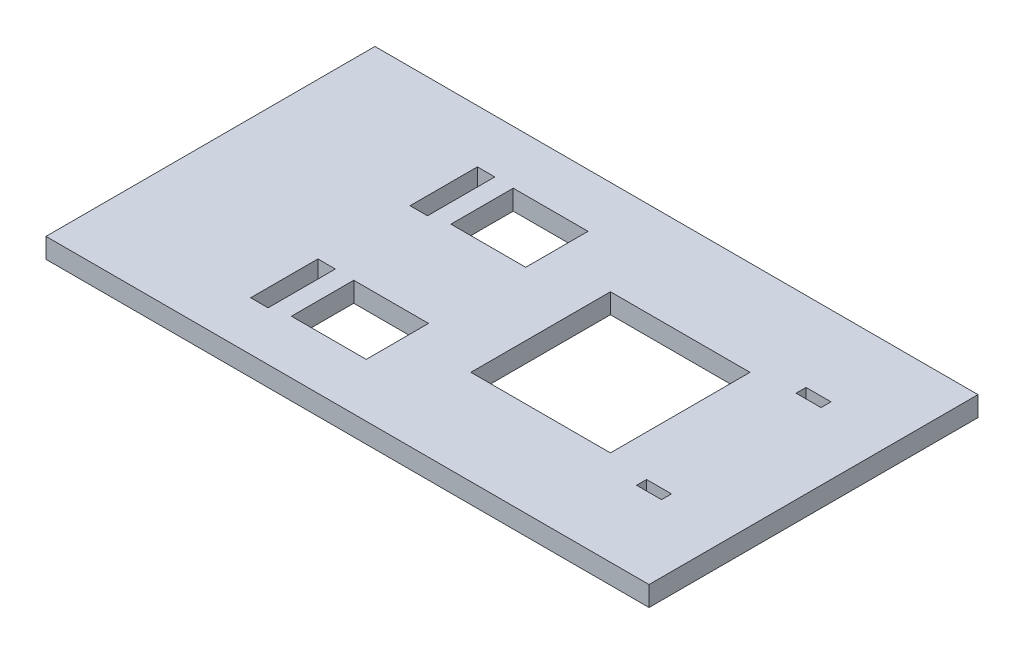
ISO-10303-21;
HEADER;
FILE_DESCRIPTION(('STEP AP214'),'2;1');
FILE_NAME('part.step','',(''),(''),'','','');
FILE_SCHEMA(('AUTOMOTIVE_DESIGN { 1 0 10303 214 1 1 1 1 }'));
ENDSEC;
DATA;
#1=APPLICATION_CONTEXT('core data for automotive mechanical design processes');
#2=APPLICATION_PROTOCOL_DEFINITION('international standard','automotive_design',2000,#1);
#3=PRODUCT_CONTEXT('',#1,'mechanical');
#4=PRODUCT('Part','Part','',(#3));
#5=PRODUCT_RELATED_PRODUCT_CATEGORY('part','',(#4));
#6=PRODUCT_DEFINITION_FORMATION('','',#4);
#7=PRODUCT_DEFINITION_CONTEXT('part definition',#1,'design');
#8=PRODUCT_DEFINITION('design','',#6,#7);
#9=PRODUCT_DEFINITION_SHAPE('','',#8);
#10=(LENGTH_UNIT() NAMED_UNIT(*) SI_UNIT(.MILLI.,.METRE.));
#11=(NAMED_UNIT(*) PLANE_ANGLE_UNIT() SI_UNIT($,.RADIAN.));
#12=(NAMED_UNIT(*) SI_UNIT($,.STERADIAN.) SOLID_ANGLE_UNIT());
#13=UNCERTAINTY_MEASURE_WITH_UNIT(LENGTH_MEASURE(1.E-05),#10,'distance_accuracy_value','');
#14=(GEOMETRIC_REPRESENTATION_CONTEXT(3) GLOBAL_UNCERTAINTY_ASSIGNED_CONTEXT((#13)) GLOBAL_UNIT_ASSIGNED_CONTEXT((#10,
#11,#12)) REPRESENTATION_CONTEXT('',''));
#15=CARTESIAN_POINT('',(0.,0.,0.));
#16=DIRECTION('',(0.,0.,1.));
#17=DIRECTION('',(1.,0.,0.));
#18=AXIS2_PLACEMENT_3D('',#15,#16,#17);
#19=CARTESIAN_POINT('',(0.,4.,0.));
#20=DIRECTION('',(1.,0.,0.));
#21=DIRECTION('',(0.,0.,-1.));
#22=AXIS2_PLACEMENT_3D('',#19,#20,#21);
#23=PLANE('',#22);
#24=DIRECTION('',(0.,0.,1.));
#25=VECTOR('',#24,1.);
#26=CARTESIAN_POINT('',(0.,0.,0.));
#27=LINE('',#26,#25);
#28=CARTESIAN_POINT('',(0.,0.,0.));
#29=VERTEX_POINT('',#28);
#30=CARTESIAN_POINT('',(0.,0.,66.));
#31=VERTEX_POINT('',#30);
#32=EDGE_CURVE('E403',#29,#31,#27,.T.);
#33=ORIENTED_EDGE('',*,*,#32,.T.);
#34=DIRECTION('',(0.,-1.,0.));
#35=VECTOR('',#34,1.);
#36=CARTESIAN_POINT('',(0.,4.,66.));
#37=LINE('',#36,#35);
#38=CARTESIAN_POINT('',(0.,4.,66.));
#39=VERTEX_POINT('',#38);
#40=EDGE_CURVE('E11',#39,#31,#37,.T.);
#41=ORIENTED_EDGE('',*,*,#40,.F.);
#42=DIRECTION('',(0.,0.,1.));
#43=VECTOR('',#42,1.);
#44=CARTESIAN_POINT('',(0.,4.,0.));
#45=LINE('',#44,#43);
#46=CARTESIAN_POINT('',(0.,4.,0.));
#47=VERTEX_POINT('',#46);
#48=EDGE_CURVE('E472',#47,#39,#45,.T.);
#49=ORIENTED_EDGE('',*,*,#48,.F.);
#50=DIRECTION('',(0.,-1.,0.));
#51=VECTOR('',#50,1.);
#52=CARTESIAN_POINT('',(0.,4.,0.));
#53=LINE('',#52,#51);
#54=EDGE_CURVE('E482',#47,#29,#53,.T.);
#55=ORIENTED_EDGE('',*,*,#54,.T.);
#56=EDGE_LOOP('',(#33,#41,#49,#55));
#57=FACE_BOUND('',#56,.T.);
#58=ADVANCED_FACE('F34',(#57),#23,.F.);
#59=CARTESIAN_POINT('',(0.,4.,66.));
#60=DIRECTION('',(0.,0.,-1.));
#61=DIRECTION('',(-1.,0.,0.));
#62=AXIS2_PLACEMENT_3D('',#59,#60,#61);
#63=PLANE('',#62);
#64=DIRECTION('',(1.,0.,0.));
#65=VECTOR('',#64,1.);
#66=CARTESIAN_POINT('',(0.,0.,66.));
#67=LINE('',#66,#65);
#68=CARTESIAN_POINT('',(121.,0.,66.));
#69=VERTEX_POINT('',#68);
#70=EDGE_CURVE('E485',#31,#69,#67,.T.);
#71=ORIENTED_EDGE('',*,*,#70,.T.);
#72=DIRECTION('',(0.,-1.,0.));
#73=VECTOR('',#72,1.);
#74=CARTESIAN_POINT('',(121.,4.,66.));
#75=LINE('',#74,#73);
#76=CARTESIAN_POINT('',(121.,4.,66.));
#77=VERTEX_POINT('',#76);
#78=EDGE_CURVE('E41',#77,#69,#75,.T.);
#79=ORIENTED_EDGE('',*,*,#78,.F.);
#80=DIRECTION('',(1.,0.,0.));
#81=VECTOR('',#80,1.);
#82=CARTESIAN_POINT('',(0.,4.,66.));
#83=LINE('',#82,#81);
#84=EDGE_CURVE('E475',#39,#77,#83,.T.);
#85=ORIENTED_EDGE('',*,*,#84,.F.);
#86=ORIENTED_EDGE('',*,*,#40,.T.);
#87=EDGE_LOOP('',(#71,#79,#85,#86));
#88=FACE_BOUND('',#87,.T.);
#89=ADVANCED_FACE('F514',(#88),#63,.F.);
#90=CARTESIAN_POINT('',(121.,4.,0.));
#91=DIRECTION('',(-1.,0.,0.));
#92=DIRECTION('',(0.,0.,1.));
#93=AXIS2_PLACEMENT_3D('',#90,#91,#92);
#94=PLANE('',#93);
#95=DIRECTION('',(0.,0.,-1.));
#96=VECTOR('',#95,1.);
#97=CARTESIAN_POINT('',(121.,0.,0.));
#98=LINE('',#97,#96);
#99=CARTESIAN_POINT('',(121.,0.,0.));
#100=VERTEX_POINT('',#99);
#101=EDGE_CURVE('E487',#69,#100,#98,.T.);
#102=ORIENTED_EDGE('',*,*,#101,.T.);
#103=DIRECTION('',(0.,-1.,0.));
#104=VECTOR('',#103,1.);
#105=CARTESIAN_POINT('',(121.,4.,0.));
#106=LINE('',#105,#104);
#107=CARTESIAN_POINT('',(121.,4.,0.));
#108=VERTEX_POINT('',#107);
#109=EDGE_CURVE('E492',#108,#100,#106,.T.);
#110=ORIENTED_EDGE('',*,*,#109,.F.);
#111=DIRECTION('',(0.,0.,-1.));
#112=VECTOR('',#111,1.);
#113=CARTESIAN_POINT('',(121.,4.,0.));
#114=LINE('',#113,#112);
#115=EDGE_CURVE('E478',#77,#108,#114,.T.);
#116=ORIENTED_EDGE('',*,*,#115,.F.);
#117=ORIENTED_EDGE('',*,*,#78,.T.);
#118=EDGE_LOOP('',(#102,#110,#116,#117));
#119=FACE_BOUND('',#118,.T.);
#120=ADVANCED_FACE('F499',(#119),#94,.F.);
#121=CARTESIAN_POINT('',(0.,4.,0.));
#122=DIRECTION('',(0.,0.,1.));
#123=DIRECTION('',(1.,0.,0.));
#124=AXIS2_PLACEMENT_3D('',#121,#122,#123);
#125=PLANE('',#124);
#126=DIRECTION('',(-1.,0.,0.));
#127=VECTOR('',#126,1.);
#128=CARTESIAN_POINT('',(0.,0.,0.));
#129=LINE('',#128,#127);
#130=EDGE_CURVE('E476',#100,#29,#129,.T.);
#131=ORIENTED_EDGE('',*,*,#130,.T.);
#132=ORIENTED_EDGE('',*,*,#54,.F.);
#133=DIRECTION('',(-1.,0.,0.));
#134=VECTOR('',#133,1.);
#135=CARTESIAN_POINT('',(0.,4.,0.));
#136=LINE('',#135,#134);
#137=EDGE_CURVE('E480',#108,#47,#136,.T.);
#138=ORIENTED_EDGE('',*,*,#137,.F.);
#139=ORIENTED_EDGE('',*,*,#109,.T.);
#140=EDGE_LOOP('',(#131,#132,#138,#139));
#141=FACE_BOUND('',#140,.T.);
#142=ADVANCED_FACE('F507',(#141),#125,.F.);
#143=CARTESIAN_POINT('',(0.,4.,0.));
#144=DIRECTION('',(0.,1.,0.));
#145=DIRECTION('',(0.,0.,1.));
#146=AXIS2_PLACEMENT_3D('',#143,#144,#145);
#147=PLANE('',#146);
#148=DIRECTION('',(0.,0.,1.));
#149=VECTOR('',#148,1.);
#150=CARTESIAN_POINT('',(31.2,4.,42.6458957568744));
#151=LINE('',#150,#149);
#152=CARTESIAN_POINT('',(31.2,4.,42.6458957568744));
#153=VERTEX_POINT('',#152);
#154=CARTESIAN_POINT('',(31.2,4.,56.1458957568744));
#155=VERTEX_POINT('',#154);
#156=EDGE_CURVE('E48',#153,#155,#151,.T.);
#157=ORIENTED_EDGE('',*,*,#156,.F.);
#158=DIRECTION('',(-1.,0.,0.));
#159=VECTOR('',#158,1.);
#160=CARTESIAN_POINT('',(31.2,4.,42.6458957568744));
#161=LINE('',#160,#159);
#162=CARTESIAN_POINT('',(34.7,4.,42.6458957568744));
#163=VERTEX_POINT('',#162);
#164=EDGE_CURVE('E263',#163,#153,#161,.T.);
#165=ORIENTED_EDGE('',*,*,#164,.F.);
#166=DIRECTION('',(0.,0.,-1.));
#167=VECTOR('',#166,1.);
#168=CARTESIAN_POINT('',(34.7,4.,42.6458957568744));
#169=LINE('',#168,#167);
#170=CARTESIAN_POINT('',(34.7,4.,56.1458957568744));
#171=VERTEX_POINT('',#170);
#172=EDGE_CURVE('E266',#171,#163,#169,.T.);
#173=ORIENTED_EDGE('',*,*,#172,.F.);
#174=DIRECTION('',(1.,0.,0.));
#175=VECTOR('',#174,1.);
#176=CARTESIAN_POINT('',(31.2,4.,56.1458957568744));
#177=LINE('',#176,#175);
#178=EDGE_CURVE('E272',#155,#171,#177,.T.);
#179=ORIENTED_EDGE('',*,*,#178,.F.);
#180=EDGE_LOOP('',(#157,#165,#173,#179));
#181=FACE_BOUND('',#180,.T.);
#182=DIRECTION('',(0.,0.,1.));
#183=VECTOR('',#182,1.);
#184=CARTESIAN_POINT('',(31.2,4.,10.6496253107313));
#185=LINE('',#184,#183);
#186=CARTESIAN_POINT('',(31.2,4.,10.6496253107313));
#187=VERTEX_POINT('',#186);
#188=CARTESIAN_POINT('',(31.2,4.,24.1496253107313));
#189=VERTEX_POINT('',#188);
#190=EDGE_CURVE('E56',#187,#189,#185,.T.);
#191=ORIENTED_EDGE('',*,*,#190,.F.);
#192=DIRECTION('',(-1.,0.,0.));
#193=VECTOR('',#192,1.);
#194=CARTESIAN_POINT('',(31.2,4.,10.6496253107313));
#195=LINE('',#194,#193);
#196=CARTESIAN_POINT('',(34.7,4.,10.6496253107313));
#197=VERTEX_POINT('',#196);
#198=EDGE_CURVE('E287',#197,#187,#195,.T.);
#199=ORIENTED_EDGE('',*,*,#198,.F.);
#200=DIRECTION('',(0.,0.,-1.));
#201=VECTOR('',#200,1.);
#202=CARTESIAN_POINT('',(34.7,4.,10.6496253107313));
#203=LINE('',#202,#201);
#204=CARTESIAN_POINT('',(34.7,4.,24.1496253107313));
#205=VERTEX_POINT('',#204);
#206=EDGE_CURVE('E301',#205,#197,#203,.T.);
#207=ORIENTED_EDGE('',*,*,#206,.F.);
#208=DIRECTION('',(1.,0.,0.));
#209=VECTOR('',#208,1.);
#210=CARTESIAN_POINT('',(31.2,4.,24.1496253107313));
#211=LINE('',#210,#209);
#212=EDGE_CURVE('E298',#189,#205,#211,.T.);
#213=ORIENTED_EDGE('',*,*,#212,.F.);
#214=EDGE_LOOP('',(#191,#199,#207,#213));
#215=FACE_BOUND('',#214,.T.);
#216=DIRECTION('',(0.,0.,1.));
#217=VECTOR('',#216,1.);
#218=CARTESIAN_POINT('',(107.5,4.,50.));
#219=LINE('',#218,#217);
#220=CARTESIAN_POINT('',(107.5,4.,48.));
#221=VERTEX_POINT('',#220);
#222=CARTESIAN_POINT('',(107.5,4.,50.));
#223=VERTEX_POINT('',#222);
#224=EDGE_CURVE('E312',#221,#223,#219,.T.);
#225=ORIENTED_EDGE('',*,*,#224,.T.);
#226=DIRECTION('',(-1.,0.,0.));
#227=VECTOR('',#226,1.);
#228=CARTESIAN_POINT('',(107.5,4.,50.));
#229=LINE('',#228,#227);
#230=CARTESIAN_POINT('',(102.5,4.,50.));
#231=VERTEX_POINT('',#230);
#232=EDGE_CURVE('E315',#223,#231,#229,.T.);
#233=ORIENTED_EDGE('',*,*,#232,.T.);
#234=DIRECTION('',(0.,0.,-1.));
#235=VECTOR('',#234,1.);
#236=CARTESIAN_POINT('',(102.5,4.,50.));
#237=LINE('',#236,#235);
#238=CARTESIAN_POINT('',(102.5,4.,48.));
#239=VERTEX_POINT('',#238);
#240=EDGE_CURVE('E319',#231,#239,#237,.T.);
#241=ORIENTED_EDGE('',*,*,#240,.T.);
#242=DIRECTION('',(1.,0.,0.));
#243=VECTOR('',#242,1.);
#244=CARTESIAN_POINT('',(107.5,4.,48.));
#245=LINE('',#244,#243);
#246=EDGE_CURVE('E322',#239,#221,#245,.T.);
#247=ORIENTED_EDGE('',*,*,#246,.T.);
#248=EDGE_LOOP('',(#225,#233,#241,#247));
#249=FACE_BOUND('',#248,.T.);
#250=DIRECTION('',(0.,0.,-1.));
#251=VECTOR('',#250,1.);
#252=CARTESIAN_POINT('',(102.5,4.,16.));
#253=LINE('',#252,#251);
#254=CARTESIAN_POINT('',(102.5,4.,18.));
#255=VERTEX_POINT('',#254);
#256=CARTESIAN_POINT('',(102.5,4.,16.));
#257=VERTEX_POINT('',#256);
#258=EDGE_CURVE('E346',#255,#257,#253,.T.);
#259=ORIENTED_EDGE('',*,*,#258,.T.);
#260=DIRECTION('',(1.,0.,0.));
#261=VECTOR('',#260,1.);
#262=CARTESIAN_POINT('',(102.5,4.,16.));
#263=LINE('',#262,#261);
#264=CARTESIAN_POINT('',(107.5,4.,16.));
#265=VERTEX_POINT('',#264);
#266=EDGE_CURVE('E349',#257,#265,#263,.T.);
#267=ORIENTED_EDGE('',*,*,#266,.T.);
#268=DIRECTION('',(0.,0.,1.));
#269=VECTOR('',#268,1.);
#270=CARTESIAN_POINT('',(107.5,4.,16.));
#271=LINE('',#270,#269);
#272=CARTESIAN_POINT('',(107.5,4.,18.));
#273=VERTEX_POINT('',#272);
#274=EDGE_CURVE('E353',#265,#273,#271,.T.);
#275=ORIENTED_EDGE('',*,*,#274,.T.);
#276=DIRECTION('',(-1.,0.,0.));
#277=VECTOR('',#276,1.);
#278=CARTESIAN_POINT('',(102.5,4.,18.));
#279=LINE('',#278,#277);
#280=EDGE_CURVE('E356',#273,#255,#279,.T.);
#281=ORIENTED_EDGE('',*,*,#280,.T.);
#282=EDGE_LOOP('',(#259,#267,#275,#281));
#283=FACE_BOUND('',#282,.T.);
#284=DIRECTION('',(0.,0.,-1.));
#285=VECTOR('',#284,1.);
#286=CARTESIAN_POINT('',(94.25,4.,19.));
#287=LINE('',#286,#285);
#288=CARTESIAN_POINT('',(94.25,4.,47.));
#289=VERTEX_POINT('',#288);
#290=CARTESIAN_POINT('',(94.25,4.,19.));
#291=VERTEX_POINT('',#290);
#292=EDGE_CURVE('E390',#289,#291,#287,.T.);
#293=ORIENTED_EDGE('',*,*,#292,.F.);
#294=DIRECTION('',(1.,0.,0.));
#295=VECTOR('',#294,1.);
#296=CARTESIAN_POINT('',(66.25,4.,47.));
#297=LINE('',#296,#295);
#298=CARTESIAN_POINT('',(66.25,4.,47.));
#299=VERTEX_POINT('',#298);
#300=EDGE_CURVE('E380',#299,#289,#297,.T.);
#301=ORIENTED_EDGE('',*,*,#300,.F.);
#302=DIRECTION('',(0.,0.,1.));
#303=VECTOR('',#302,1.);
#304=CARTESIAN_POINT('',(66.25,4.,19.));
#305=LINE('',#304,#303);
#306=CARTESIAN_POINT('',(66.25,4.,19.));
#307=VERTEX_POINT('',#306);
#308=EDGE_CURVE('E396',#307,#299,#305,.T.);
#309=ORIENTED_EDGE('',*,*,#308,.F.);
#310=DIRECTION('',(-1.,0.,0.));
#311=VECTOR('',#310,1.);
#312=CARTESIAN_POINT('',(66.25,4.,19.));
#313=LINE('',#312,#311);
#314=EDGE_CURVE('E392',#291,#307,#313,.T.);
#315=ORIENTED_EDGE('',*,*,#314,.F.);
#316=EDGE_LOOP('',(#293,#301,#309,#315));
#317=FACE_BOUND('',#316,.T.);
#318=DIRECTION('',(0.,0.,-1.));
#319=VECTOR('',#318,1.);
#320=CARTESIAN_POINT('',(53.5,4.,23.25));
#321=LINE('',#320,#319);
#322=CARTESIAN_POINT('',(53.5,4.,23.25));
#323=VERTEX_POINT('',#322);
#324=CARTESIAN_POINT('',(53.5,4.,10.75));
#325=VERTEX_POINT('',#324);
#326=EDGE_CURVE('E424',#323,#325,#321,.T.);
#327=ORIENTED_EDGE('',*,*,#326,.F.);
#328=DIRECTION('',(1.,0.,0.));
#329=VECTOR('',#328,1.);
#330=CARTESIAN_POINT('',(38.5,4.,23.25));
#331=LINE('',#330,#329);
#332=CARTESIAN_POINT('',(38.5,4.,23.25));
#333=VERTEX_POINT('',#332);
#334=EDGE_CURVE('E414',#333,#323,#331,.T.);
#335=ORIENTED_EDGE('',*,*,#334,.F.);
#336=DIRECTION('',(0.,0.,1.));
#337=VECTOR('',#336,1.);
#338=CARTESIAN_POINT('',(38.5,4.,23.25));
#339=LINE('',#338,#337);
#340=CARTESIAN_POINT('',(38.5,4.,10.75));
#341=VERTEX_POINT('',#340);
#342=EDGE_CURVE('E430',#341,#333,#339,.T.);
#343=ORIENTED_EDGE('',*,*,#342,.F.);
#344=DIRECTION('',(-1.,0.,0.));
#345=VECTOR('',#344,1.);
#346=CARTESIAN_POINT('',(38.5,4.,10.75));
#347=LINE('',#346,#345);
#348=EDGE_CURVE('E426',#325,#341,#347,.T.);
#349=ORIENTED_EDGE('',*,*,#348,.F.);
#350=EDGE_LOOP('',(#327,#335,#343,#349));
#351=FACE_BOUND('',#350,.T.);
#352=DIRECTION('',(0.,0.,-1.));
#353=VECTOR('',#352,1.);
#354=CARTESIAN_POINT('',(53.5,4.,55.25));
#355=LINE('',#354,#353);
#356=CARTESIAN_POINT('',(53.5,4.,55.25));
#357=VERTEX_POINT('',#356);
#358=CARTESIAN_POINT('',(53.5,4.,42.75));
#359=VERTEX_POINT('',#358);
#360=EDGE_CURVE('E339',#357,#359,#355,.T.);
#361=ORIENTED_EDGE('',*,*,#360,.F.);
#362=DIRECTION('',(1.,0.,0.));
#363=VECTOR('',#362,1.);
#364=CARTESIAN_POINT('',(38.5,4.,55.25));
#365=LINE('',#364,#363);
#366=CARTESIAN_POINT('',(38.5,4.,55.25));
#367=VERTEX_POINT('',#366);
#368=EDGE_CURVE('E446',#367,#357,#365,.T.);
#369=ORIENTED_EDGE('',*,*,#368,.F.);
#370=DIRECTION('',(0.,0.,1.));
#371=VECTOR('',#370,1.);
#372=CARTESIAN_POINT('',(38.5,4.,55.25));
#373=LINE('',#372,#371);
#374=CARTESIAN_POINT('',(38.5,4.,42.75));
#375=VERTEX_POINT('',#374);
#376=EDGE_CURVE('E460',#375,#367,#373,.T.);
#377=ORIENTED_EDGE('',*,*,#376,.F.);
#378=DIRECTION('',(-1.,0.,0.));
#379=VECTOR('',#378,1.);
#380=CARTESIAN_POINT('',(38.5,4.,42.75));
#381=LINE('',#380,#379);
#382=EDGE_CURVE('E457',#359,#375,#381,.T.);
#383=ORIENTED_EDGE('',*,*,#382,.F.);
#384=EDGE_LOOP('',(#361,#369,#377,#383));
#385=FACE_BOUND('',#384,.T.);
#386=ORIENTED_EDGE('',*,*,#48,.T.);
#387=ORIENTED_EDGE('',*,*,#84,.T.);
#388=ORIENTED_EDGE('',*,*,#115,.T.);
#389=ORIENTED_EDGE('',*,*,#137,.T.);
#390=EDGE_LOOP('',(#386,#387,#388,#389));
#391=FACE_BOUND('',#390,.T.);
#392=ADVANCED_FACE('F513',(#181,#215,#249,#283,#317,#351,#385,#391),#147,.T.);
#393=CARTESIAN_POINT('',(0.,0.,0.));
#394=DIRECTION('',(0.,1.,0.));
#395=DIRECTION('',(0.,0.,1.));
#396=AXIS2_PLACEMENT_3D('',#393,#394,#395);
#397=PLANE('',#396);
#398=DIRECTION('',(-1.,0.,0.));
#399=VECTOR('',#398,1.);
#400=CARTESIAN_POINT('',(31.2,0.,42.6458957568744));
#401=LINE('',#400,#399);
#402=CARTESIAN_POINT('',(34.7,0.,42.6458957568744));
#403=VERTEX_POINT('',#402);
#404=CARTESIAN_POINT('',(31.2,0.,42.6458957568744));
#405=VERTEX_POINT('',#404);
#406=EDGE_CURVE('E250',#403,#405,#401,.T.);
#407=ORIENTED_EDGE('',*,*,#406,.T.);
#408=DIRECTION('',(0.,0.,1.));
#409=VECTOR('',#408,1.);
#410=CARTESIAN_POINT('',(31.2,0.,42.6458957568744));
#411=LINE('',#410,#409);
#412=CARTESIAN_POINT('',(31.2,0.,56.1458957568744));
#413=VERTEX_POINT('',#412);
#414=EDGE_CURVE('E244',#405,#413,#411,.T.);
#415=ORIENTED_EDGE('',*,*,#414,.T.);
#416=DIRECTION('',(1.,0.,0.));
#417=VECTOR('',#416,1.);
#418=CARTESIAN_POINT('',(31.2,0.,56.1458957568744));
#419=LINE('',#418,#417);
#420=CARTESIAN_POINT('',(34.7,0.,56.1458957568744));
#421=VERTEX_POINT('',#420);
#422=EDGE_CURVE('E254',#413,#421,#419,.T.);
#423=ORIENTED_EDGE('',*,*,#422,.T.);
#424=DIRECTION('',(0.,0.,-1.));
#425=VECTOR('',#424,1.);
#426=CARTESIAN_POINT('',(34.7,0.,42.6458957568744));
#427=LINE('',#426,#425);
#428=EDGE_CURVE('E258',#421,#403,#427,.T.);
#429=ORIENTED_EDGE('',*,*,#428,.T.);
#430=EDGE_LOOP('',(#407,#415,#423,#429));
#431=FACE_BOUND('',#430,.T.);
#432=DIRECTION('',(-1.,0.,0.));
#433=VECTOR('',#432,1.);
#434=CARTESIAN_POINT('',(31.2,0.,10.6496253107313));
#435=LINE('',#434,#433);
#436=CARTESIAN_POINT('',(34.7,0.,10.6496253107313));
#437=VERTEX_POINT('',#436);
#438=CARTESIAN_POINT('',(31.2,0.,10.6496253107313));
#439=VERTEX_POINT('',#438);
#440=EDGE_CURVE('E293',#437,#439,#435,.T.);
#441=ORIENTED_EDGE('',*,*,#440,.T.);
#442=DIRECTION('',(0.,0.,1.));
#443=VECTOR('',#442,1.);
#444=CARTESIAN_POINT('',(31.2,0.,10.6496253107313));
#445=LINE('',#444,#443);
#446=CARTESIAN_POINT('',(31.2,0.,24.1496253107313));
#447=VERTEX_POINT('',#446);
#448=EDGE_CURVE('E283',#439,#447,#445,.T.);
#449=ORIENTED_EDGE('',*,*,#448,.T.);
#450=DIRECTION('',(1.,0.,0.));
#451=VECTOR('',#450,1.);
#452=CARTESIAN_POINT('',(31.2,0.,24.1496253107313));
#453=LINE('',#452,#451);
#454=CARTESIAN_POINT('',(34.7,0.,24.1496253107313));
#455=VERTEX_POINT('',#454);
#456=EDGE_CURVE('E286',#447,#455,#453,.T.);
#457=ORIENTED_EDGE('',*,*,#456,.T.);
#458=DIRECTION('',(0.,0.,-1.));
#459=VECTOR('',#458,1.);
#460=CARTESIAN_POINT('',(34.7,0.,10.6496253107313));
#461=LINE('',#460,#459);
#462=EDGE_CURVE('E290',#455,#437,#461,.T.);
#463=ORIENTED_EDGE('',*,*,#462,.T.);
#464=EDGE_LOOP('',(#441,#449,#457,#463));
#465=FACE_BOUND('',#464,.T.);
#466=DIRECTION('',(-1.,0.,0.));
#467=VECTOR('',#466,1.);
#468=CARTESIAN_POINT('',(107.5,0.,50.));
#469=LINE('',#468,#467);
#470=CARTESIAN_POINT('',(107.5,0.,50.));
#471=VERTEX_POINT('',#470);
#472=CARTESIAN_POINT('',(102.5,0.,50.));
#473=VERTEX_POINT('',#472);
#474=EDGE_CURVE('E328',#471,#473,#469,.T.);
#475=ORIENTED_EDGE('',*,*,#474,.F.);
#476=DIRECTION('',(0.,0.,1.));
#477=VECTOR('',#476,1.);
#478=CARTESIAN_POINT('',(107.5,0.,50.));
#479=LINE('',#478,#477);
#480=CARTESIAN_POINT('',(107.5,0.,48.));
#481=VERTEX_POINT('',#480);
#482=EDGE_CURVE('E326',#481,#471,#479,.T.);
#483=ORIENTED_EDGE('',*,*,#482,.F.);
#484=DIRECTION('',(1.,0.,0.));
#485=VECTOR('',#484,1.);
#486=CARTESIAN_POINT('',(107.5,0.,48.));
#487=LINE('',#486,#485);
#488=CARTESIAN_POINT('',(102.5,0.,48.));
#489=VERTEX_POINT('',#488);
#490=EDGE_CURVE('E316',#489,#481,#487,.T.);
#491=ORIENTED_EDGE('',*,*,#490,.F.);
#492=DIRECTION('',(0.,0.,-1.));
#493=VECTOR('',#492,1.);
#494=CARTESIAN_POINT('',(102.5,0.,50.));
#495=LINE('',#494,#493);
#496=EDGE_CURVE('E332',#473,#489,#495,.T.);
#497=ORIENTED_EDGE('',*,*,#496,.F.);
#498=EDGE_LOOP('',(#475,#483,#491,#497));
#499=FACE_BOUND('',#498,.T.);
#500=DIRECTION('',(1.,0.,0.));
#501=VECTOR('',#500,1.);
#502=CARTESIAN_POINT('',(102.5,0.,16.));
#503=LINE('',#502,#501);
#504=CARTESIAN_POINT('',(102.5,0.,16.));
#505=VERTEX_POINT('',#504);
#506=CARTESIAN_POINT('',(107.5,0.,16.));
#507=VERTEX_POINT('',#506);
#508=EDGE_CURVE('E361',#505,#507,#503,.T.);
#509=ORIENTED_EDGE('',*,*,#508,.F.);
#510=DIRECTION('',(0.,0.,-1.));
#511=VECTOR('',#510,1.);
#512=CARTESIAN_POINT('',(102.5,0.,16.));
#513=LINE('',#512,#511);
#514=CARTESIAN_POINT('',(102.5,0.,18.));
#515=VERTEX_POINT('',#514);
#516=EDGE_CURVE('E279',#515,#505,#513,.T.);
#517=ORIENTED_EDGE('',*,*,#516,.F.);
#518=DIRECTION('',(-1.,0.,0.));
#519=VECTOR('',#518,1.);
#520=CARTESIAN_POINT('',(102.5,0.,18.));
#521=LINE('',#520,#519);
#522=CARTESIAN_POINT('',(107.5,0.,18.));
#523=VERTEX_POINT('',#522);
#524=EDGE_CURVE('E350',#523,#515,#521,.T.);
#525=ORIENTED_EDGE('',*,*,#524,.F.);
#526=DIRECTION('',(0.,0.,1.));
#527=VECTOR('',#526,1.);
#528=CARTESIAN_POINT('',(107.5,0.,16.));
#529=LINE('',#528,#527);
#530=EDGE_CURVE('E364',#507,#523,#529,.T.);
#531=ORIENTED_EDGE('',*,*,#530,.F.);
#532=EDGE_LOOP('',(#509,#517,#525,#531));
#533=FACE_BOUND('',#532,.T.);
#534=DIRECTION('',(1.,0.,0.));
#535=VECTOR('',#534,1.);
#536=CARTESIAN_POINT('',(66.25,0.,47.));
#537=LINE('',#536,#535);
#538=CARTESIAN_POINT('',(66.25,0.,47.));
#539=VERTEX_POINT('',#538);
#540=CARTESIAN_POINT('',(94.25,0.,47.));
#541=VERTEX_POINT('',#540);
#542=EDGE_CURVE('E386',#539,#541,#537,.T.);
#543=ORIENTED_EDGE('',*,*,#542,.T.);
#544=DIRECTION('',(0.,0.,-1.));
#545=VECTOR('',#544,1.);
#546=CARTESIAN_POINT('',(94.25,0.,19.));
#547=LINE('',#546,#545);
#548=CARTESIAN_POINT('',(94.25,0.,19.));
#549=VERTEX_POINT('',#548);
#550=EDGE_CURVE('E376',#541,#549,#547,.T.);
#551=ORIENTED_EDGE('',*,*,#550,.T.);
#552=DIRECTION('',(-1.,0.,0.));
#553=VECTOR('',#552,1.);
#554=CARTESIAN_POINT('',(66.25,0.,19.));
#555=LINE('',#554,#553);
#556=CARTESIAN_POINT('',(66.25,0.,19.));
#557=VERTEX_POINT('',#556);
#558=EDGE_CURVE('E379',#549,#557,#555,.T.);
#559=ORIENTED_EDGE('',*,*,#558,.T.);
#560=DIRECTION('',(0.,0.,1.));
#561=VECTOR('',#560,1.);
#562=CARTESIAN_POINT('',(66.25,0.,19.));
#563=LINE('',#562,#561);
#564=EDGE_CURVE('E383',#557,#539,#563,.T.);
#565=ORIENTED_EDGE('',*,*,#564,.T.);
#566=EDGE_LOOP('',(#543,#551,#559,#565));
#567=FACE_BOUND('',#566,.T.);
#568=DIRECTION('',(1.,0.,0.));
#569=VECTOR('',#568,1.);
#570=CARTESIAN_POINT('',(38.5,0.,23.25));
#571=LINE('',#570,#569);
#572=CARTESIAN_POINT('',(38.5,0.,23.25));
#573=VERTEX_POINT('',#572);
#574=CARTESIAN_POINT('',(53.5,0.,23.25));
#575=VERTEX_POINT('',#574);
#576=EDGE_CURVE('E420',#573,#575,#571,.T.);
#577=ORIENTED_EDGE('',*,*,#576,.T.);
#578=DIRECTION('',(0.,0.,-1.));
#579=VECTOR('',#578,1.);
#580=CARTESIAN_POINT('',(53.5,0.,23.25));
#581=LINE('',#580,#579);
#582=CARTESIAN_POINT('',(53.5,0.,10.75));
#583=VERTEX_POINT('',#582);
#584=EDGE_CURVE('E410',#575,#583,#581,.T.);
#585=ORIENTED_EDGE('',*,*,#584,.T.);
#586=DIRECTION('',(-1.,0.,0.));
#587=VECTOR('',#586,1.);
#588=CARTESIAN_POINT('',(38.5,0.,10.75));
#589=LINE('',#588,#587);
#590=CARTESIAN_POINT('',(38.5,0.,10.75));
#591=VERTEX_POINT('',#590);
#592=EDGE_CURVE('E413',#583,#591,#589,.T.);
#593=ORIENTED_EDGE('',*,*,#592,.T.);
#594=DIRECTION('',(0.,0.,1.));
#595=VECTOR('',#594,1.);
#596=CARTESIAN_POINT('',(38.5,0.,23.25));
#597=LINE('',#596,#595);
#598=EDGE_CURVE('E417',#591,#573,#597,.T.);
#599=ORIENTED_EDGE('',*,*,#598,.T.);
#600=EDGE_LOOP('',(#577,#585,#593,#599));
#601=FACE_BOUND('',#600,.T.);
#602=DIRECTION('',(1.,0.,0.));
#603=VECTOR('',#602,1.);
#604=CARTESIAN_POINT('',(38.5,0.,55.25));
#605=LINE('',#604,#603);
#606=CARTESIAN_POINT('',(38.5,0.,55.25));
#607=VERTEX_POINT('',#606);
#608=CARTESIAN_POINT('',(53.5,0.,55.25));
#609=VERTEX_POINT('',#608);
#610=EDGE_CURVE('E452',#607,#609,#605,.T.);
#611=ORIENTED_EDGE('',*,*,#610,.T.);
#612=DIRECTION('',(0.,0.,-1.));
#613=VECTOR('',#612,1.);
#614=CARTESIAN_POINT('',(53.5,0.,55.25));
#615=LINE('',#614,#613);
#616=CARTESIAN_POINT('',(53.5,0.,42.75));
#617=VERTEX_POINT('',#616);
#618=EDGE_CURVE('E442',#609,#617,#615,.T.);
#619=ORIENTED_EDGE('',*,*,#618,.T.);
#620=DIRECTION('',(-1.,0.,0.));
#621=VECTOR('',#620,1.);
#622=CARTESIAN_POINT('',(38.5,0.,42.75));
#623=LINE('',#622,#621);
#624=CARTESIAN_POINT('',(38.5,0.,42.75));
#625=VERTEX_POINT('',#624);
#626=EDGE_CURVE('E445',#617,#625,#623,.T.);
#627=ORIENTED_EDGE('',*,*,#626,.T.);
#628=DIRECTION('',(0.,0.,1.));
#629=VECTOR('',#628,1.);
#630=CARTESIAN_POINT('',(38.5,0.,55.25));
#631=LINE('',#630,#629);
#632=EDGE_CURVE('E449',#625,#607,#631,.T.);
#633=ORIENTED_EDGE('',*,*,#632,.T.);
#634=EDGE_LOOP('',(#611,#619,#627,#633));
#635=FACE_BOUND('',#634,.T.);
#636=ORIENTED_EDGE('',*,*,#32,.F.);
#637=ORIENTED_EDGE('',*,*,#130,.F.);
#638=ORIENTED_EDGE('',*,*,#101,.F.);
#639=ORIENTED_EDGE('',*,*,#70,.F.);
#640=EDGE_LOOP('',(#636,#637,#638,#639));
#641=FACE_BOUND('',#640,.T.);
#642=ADVANCED_FACE('F260',(#431,#465,#499,#533,#567,#601,#635,#641),#397,.F.);
#643=CARTESIAN_POINT('',(53.5,0.,55.25));
#644=DIRECTION('',(1.,0.,0.));
#645=DIRECTION('',(0.,0.,-1.));
#646=AXIS2_PLACEMENT_3D('',#643,#644,#645);
#647=PLANE('',#646);
#648=ORIENTED_EDGE('',*,*,#360,.T.);
#649=DIRECTION('',(0.,1.,0.));
#650=VECTOR('',#649,1.);
#651=CARTESIAN_POINT('',(53.5,0.,42.75));
#652=LINE('',#651,#650);
#653=EDGE_CURVE('E455',#617,#359,#652,.T.);
#654=ORIENTED_EDGE('',*,*,#653,.F.);
#655=ORIENTED_EDGE('',*,*,#618,.F.);
#656=DIRECTION('',(0.,1.,0.));
#657=VECTOR('',#656,1.);
#658=CARTESIAN_POINT('',(53.5,0.,55.25));
#659=LINE('',#658,#657);
#660=EDGE_CURVE('E427',#609,#357,#659,.T.);
#661=ORIENTED_EDGE('',*,*,#660,.T.);
#662=EDGE_LOOP('',(#648,#654,#655,#661));
#663=FACE_BOUND('',#662,.T.);
#664=ADVANCED_FACE('F526',(#663),#647,.F.);
#665=CARTESIAN_POINT('',(38.5,0.,55.25));
#666=DIRECTION('',(0.,0.,1.));
#667=DIRECTION('',(1.,0.,0.));
#668=AXIS2_PLACEMENT_3D('',#665,#666,#667);
#669=PLANE('',#668);
#670=ORIENTED_EDGE('',*,*,#368,.T.);
#671=ORIENTED_EDGE('',*,*,#660,.F.);
#672=ORIENTED_EDGE('',*,*,#610,.F.);
#673=DIRECTION('',(0.,1.,0.));
#674=VECTOR('',#673,1.);
#675=CARTESIAN_POINT('',(38.5,0.,55.25));
#676=LINE('',#675,#674);
#677=EDGE_CURVE('E466',#607,#367,#676,.T.);
#678=ORIENTED_EDGE('',*,*,#677,.T.);
#679=EDGE_LOOP('',(#670,#671,#672,#678));
#680=FACE_BOUND('',#679,.T.);
#681=ADVANCED_FACE('F532',(#680),#669,.F.);
#682=CARTESIAN_POINT('',(38.5,0.,55.25));
#683=DIRECTION('',(-1.,0.,0.));
#684=DIRECTION('',(0.,0.,1.));
#685=AXIS2_PLACEMENT_3D('',#682,#683,#684);
#686=PLANE('',#685);
#687=ORIENTED_EDGE('',*,*,#376,.T.);
#688=ORIENTED_EDGE('',*,*,#677,.F.);
#689=ORIENTED_EDGE('',*,*,#632,.F.);
#690=DIRECTION('',(0.,1.,0.));
#691=VECTOR('',#690,1.);
#692=CARTESIAN_POINT('',(38.5,0.,42.75));
#693=LINE('',#692,#691);
#694=EDGE_CURVE('E468',#625,#375,#693,.T.);
#695=ORIENTED_EDGE('',*,*,#694,.T.);
#696=EDGE_LOOP('',(#687,#688,#689,#695));
#697=FACE_BOUND('',#696,.T.);
#698=ADVANCED_FACE('F538',(#697),#686,.F.);
#699=CARTESIAN_POINT('',(38.5,0.,42.75));
#700=DIRECTION('',(0.,0.,-1.));
#701=DIRECTION('',(-1.,0.,0.));
#702=AXIS2_PLACEMENT_3D('',#699,#700,#701);
#703=PLANE('',#702);
#704=ORIENTED_EDGE('',*,*,#382,.T.);
#705=ORIENTED_EDGE('',*,*,#694,.F.);
#706=ORIENTED_EDGE('',*,*,#626,.F.);
#707=ORIENTED_EDGE('',*,*,#653,.T.);
#708=EDGE_LOOP('',(#704,#705,#706,#707));
#709=FACE_BOUND('',#708,.T.);
#710=ADVANCED_FACE('F534',(#709),#703,.F.);
#711=CARTESIAN_POINT('',(53.5,0.,23.25));
#712=DIRECTION('',(1.,0.,0.));
#713=DIRECTION('',(0.,0.,-1.));
#714=AXIS2_PLACEMENT_3D('',#711,#712,#713);
#715=PLANE('',#714);
#716=ORIENTED_EDGE('',*,*,#326,.T.);
#717=DIRECTION('',(0.,1.,0.));
#718=VECTOR('',#717,1.);
#719=CARTESIAN_POINT('',(53.5,0.,10.75));
#720=LINE('',#719,#718);
#721=EDGE_CURVE('E423',#583,#325,#720,.T.);
#722=ORIENTED_EDGE('',*,*,#721,.F.);
#723=ORIENTED_EDGE('',*,*,#584,.F.);
#724=DIRECTION('',(0.,1.,0.));
#725=VECTOR('',#724,1.);
#726=CARTESIAN_POINT('',(53.5,0.,23.25));
#727=LINE('',#726,#725);
#728=EDGE_CURVE('E393',#575,#323,#727,.T.);
#729=ORIENTED_EDGE('',*,*,#728,.T.);
#730=EDGE_LOOP('',(#716,#722,#723,#729));
#731=FACE_BOUND('',#730,.T.);
#732=ADVANCED_FACE('F537',(#731),#715,.F.);
#733=CARTESIAN_POINT('',(38.5,0.,23.25));
#734=DIRECTION('',(0.,0.,1.));
#735=DIRECTION('',(1.,0.,0.));
#736=AXIS2_PLACEMENT_3D('',#733,#734,#735);
#737=PLANE('',#736);
#738=ORIENTED_EDGE('',*,*,#334,.T.);
#739=ORIENTED_EDGE('',*,*,#728,.F.);
#740=ORIENTED_EDGE('',*,*,#576,.F.);
#741=DIRECTION('',(0.,1.,0.));
#742=VECTOR('',#741,1.);
#743=CARTESIAN_POINT('',(38.5,0.,23.25));
#744=LINE('',#743,#742);
#745=EDGE_CURVE('E436',#573,#333,#744,.T.);
#746=ORIENTED_EDGE('',*,*,#745,.T.);
#747=EDGE_LOOP('',(#738,#739,#740,#746));
#748=FACE_BOUND('',#747,.T.);
#749=ADVANCED_FACE('F548',(#748),#737,.F.);
#750=CARTESIAN_POINT('',(38.5,0.,23.25));
#751=DIRECTION('',(-1.,0.,0.));
#752=DIRECTION('',(0.,0.,1.));
#753=AXIS2_PLACEMENT_3D('',#750,#751,#752);
#754=PLANE('',#753);
#755=ORIENTED_EDGE('',*,*,#342,.T.);
#756=ORIENTED_EDGE('',*,*,#745,.F.);
#757=ORIENTED_EDGE('',*,*,#598,.F.);
#758=DIRECTION('',(0.,1.,0.));
#759=VECTOR('',#758,1.);
#760=CARTESIAN_POINT('',(38.5,0.,10.75));
#761=LINE('',#760,#759);
#762=EDGE_CURVE('E438',#591,#341,#761,.T.);
#763=ORIENTED_EDGE('',*,*,#762,.T.);
#764=EDGE_LOOP('',(#755,#756,#757,#763));
#765=FACE_BOUND('',#764,.T.);
#766=ADVANCED_FACE('F554',(#765),#754,.F.);
#767=CARTESIAN_POINT('',(38.5,0.,10.75));
#768=DIRECTION('',(0.,0.,-1.));
#769=DIRECTION('',(-1.,0.,0.));
#770=AXIS2_PLACEMENT_3D('',#767,#768,#769);
#771=PLANE('',#770);
#772=ORIENTED_EDGE('',*,*,#348,.T.);
#773=ORIENTED_EDGE('',*,*,#762,.F.);
#774=ORIENTED_EDGE('',*,*,#592,.F.);
#775=ORIENTED_EDGE('',*,*,#721,.T.);
#776=EDGE_LOOP('',(#772,#773,#774,#775));
#777=FACE_BOUND('',#776,.T.);
#778=ADVANCED_FACE('F550',(#777),#771,.F.);
#779=CARTESIAN_POINT('',(94.25,0.,19.));
#780=DIRECTION('',(1.,0.,0.));
#781=DIRECTION('',(0.,0.,-1.));
#782=AXIS2_PLACEMENT_3D('',#779,#780,#781);
#783=PLANE('',#782);
#784=ORIENTED_EDGE('',*,*,#292,.T.);
#785=DIRECTION('',(0.,1.,0.));
#786=VECTOR('',#785,1.);
#787=CARTESIAN_POINT('',(94.25,0.,19.));
#788=LINE('',#787,#786);
#789=EDGE_CURVE('E389',#549,#291,#788,.T.);
#790=ORIENTED_EDGE('',*,*,#789,.F.);
#791=ORIENTED_EDGE('',*,*,#550,.F.);
#792=DIRECTION('',(0.,1.,0.));
#793=VECTOR('',#792,1.);
#794=CARTESIAN_POINT('',(94.25,0.,47.));
#795=LINE('',#794,#793);
#796=EDGE_CURVE('E401',#541,#289,#795,.T.);
#797=ORIENTED_EDGE('',*,*,#796,.T.);
#798=EDGE_LOOP('',(#784,#790,#791,#797));
#799=FACE_BOUND('',#798,.T.);
#800=ADVANCED_FACE('F553',(#799),#783,.F.);
#801=CARTESIAN_POINT('',(66.25,0.,47.));
#802=DIRECTION('',(0.,0.,1.));
#803=DIRECTION('',(1.,0.,0.));
#804=AXIS2_PLACEMENT_3D('',#801,#802,#803);
#805=PLANE('',#804);
#806=ORIENTED_EDGE('',*,*,#300,.T.);
#807=ORIENTED_EDGE('',*,*,#796,.F.);
#808=ORIENTED_EDGE('',*,*,#542,.F.);
#809=DIRECTION('',(0.,1.,0.));
#810=VECTOR('',#809,1.);
#811=CARTESIAN_POINT('',(66.25,0.,47.));
#812=LINE('',#811,#810);
#813=EDGE_CURVE('E404',#539,#299,#812,.T.);
#814=ORIENTED_EDGE('',*,*,#813,.T.);
#815=EDGE_LOOP('',(#806,#807,#808,#814));
#816=FACE_BOUND('',#815,.T.);
#817=ADVANCED_FACE('F564',(#816),#805,.F.);
#818=CARTESIAN_POINT('',(66.25,0.,19.));
#819=DIRECTION('',(-1.,0.,0.));
#820=DIRECTION('',(0.,0.,1.));
#821=AXIS2_PLACEMENT_3D('',#818,#819,#820);
#822=PLANE('',#821);
#823=ORIENTED_EDGE('',*,*,#308,.T.);
#824=ORIENTED_EDGE('',*,*,#813,.F.);
#825=ORIENTED_EDGE('',*,*,#564,.F.);
#826=DIRECTION('',(0.,1.,0.));
#827=VECTOR('',#826,1.);
#828=CARTESIAN_POINT('',(66.25,0.,19.));
#829=LINE('',#828,#827);
#830=EDGE_CURVE('E406',#557,#307,#829,.T.);
#831=ORIENTED_EDGE('',*,*,#830,.T.);
#832=EDGE_LOOP('',(#823,#824,#825,#831));
#833=FACE_BOUND('',#832,.T.);
#834=ADVANCED_FACE('F570',(#833),#822,.F.);
#835=CARTESIAN_POINT('',(66.25,0.,19.));
#836=DIRECTION('',(0.,0.,-1.));
#837=DIRECTION('',(-1.,0.,0.));
#838=AXIS2_PLACEMENT_3D('',#835,#836,#837);
#839=PLANE('',#838);
#840=ORIENTED_EDGE('',*,*,#314,.T.);
#841=ORIENTED_EDGE('',*,*,#830,.F.);
#842=ORIENTED_EDGE('',*,*,#558,.F.);
#843=ORIENTED_EDGE('',*,*,#789,.T.);
#844=EDGE_LOOP('',(#840,#841,#842,#843));
#845=FACE_BOUND('',#844,.T.);
#846=ADVANCED_FACE('F566',(#845),#839,.F.);
#847=CARTESIAN_POINT('',(102.5,4.,16.));
#848=DIRECTION('',(-1.,0.,0.));
#849=DIRECTION('',(0.,0.,1.));
#850=AXIS2_PLACEMENT_3D('',#847,#848,#849);
#851=PLANE('',#850);
#852=ORIENTED_EDGE('',*,*,#516,.T.);
#853=DIRECTION('',(0.,-1.,0.));
#854=VECTOR('',#853,1.);
#855=CARTESIAN_POINT('',(102.5,4.,16.));
#856=LINE('',#855,#854);
#857=EDGE_CURVE('E359',#257,#505,#856,.T.);
#858=ORIENTED_EDGE('',*,*,#857,.F.);
#859=ORIENTED_EDGE('',*,*,#258,.F.);
#860=DIRECTION('',(0.,-1.,0.));
#861=VECTOR('',#860,1.);
#862=CARTESIAN_POINT('',(102.5,4.,18.));
#863=LINE('',#862,#861);
#864=EDGE_CURVE('E329',#255,#515,#863,.T.);
#865=ORIENTED_EDGE('',*,*,#864,.T.);
#866=EDGE_LOOP('',(#852,#858,#859,#865));
#867=FACE_BOUND('',#866,.T.);
#868=ADVANCED_FACE('F569',(#867),#851,.F.);
#869=CARTESIAN_POINT('',(102.5,4.,18.));
#870=DIRECTION('',(0.,0.,1.));
#871=DIRECTION('',(1.,0.,0.));
#872=AXIS2_PLACEMENT_3D('',#869,#870,#871);
#873=PLANE('',#872);
#874=ORIENTED_EDGE('',*,*,#524,.T.);
#875=ORIENTED_EDGE('',*,*,#864,.F.);
#876=ORIENTED_EDGE('',*,*,#280,.F.);
#877=DIRECTION('',(0.,-1.,0.));
#878=VECTOR('',#877,1.);
#879=CARTESIAN_POINT('',(107.5,4.,18.));
#880=LINE('',#879,#878);
#881=EDGE_CURVE('E370',#273,#523,#880,.T.);
#882=ORIENTED_EDGE('',*,*,#881,.T.);
#883=EDGE_LOOP('',(#874,#875,#876,#882));
#884=FACE_BOUND('',#883,.T.);
#885=ADVANCED_FACE('F580',(#884),#873,.F.);
#886=CARTESIAN_POINT('',(107.5,4.,16.));
#887=DIRECTION('',(1.,0.,0.));
#888=DIRECTION('',(0.,0.,-1.));
#889=AXIS2_PLACEMENT_3D('',#886,#887,#888);
#890=PLANE('',#889);
#891=ORIENTED_EDGE('',*,*,#530,.T.);
#892=ORIENTED_EDGE('',*,*,#881,.F.);
#893=ORIENTED_EDGE('',*,*,#274,.F.);
#894=DIRECTION('',(0.,-1.,0.));
#895=VECTOR('',#894,1.);
#896=CARTESIAN_POINT('',(107.5,4.,16.));
#897=LINE('',#896,#895);
#898=EDGE_CURVE('E372',#265,#507,#897,.T.);
#899=ORIENTED_EDGE('',*,*,#898,.T.);
#900=EDGE_LOOP('',(#891,#892,#893,#899));
#901=FACE_BOUND('',#900,.T.);
#902=ADVANCED_FACE('F586',(#901),#890,.F.);
#903=CARTESIAN_POINT('',(102.5,4.,16.));
#904=DIRECTION('',(0.,0.,-1.));
#905=DIRECTION('',(-1.,0.,0.));
#906=AXIS2_PLACEMENT_3D('',#903,#904,#905);
#907=PLANE('',#906);
#908=ORIENTED_EDGE('',*,*,#508,.T.);
#909=ORIENTED_EDGE('',*,*,#898,.F.);
#910=ORIENTED_EDGE('',*,*,#266,.F.);
#911=ORIENTED_EDGE('',*,*,#857,.T.);
#912=EDGE_LOOP('',(#908,#909,#910,#911));
#913=FACE_BOUND('',#912,.T.);
#914=ADVANCED_FACE('F582',(#913),#907,.F.);
#915=CARTESIAN_POINT('',(107.5,4.,50.));
#916=DIRECTION('',(1.,0.,0.));
#917=DIRECTION('',(0.,0.,-1.));
#918=AXIS2_PLACEMENT_3D('',#915,#916,#917);
#919=PLANE('',#918);
#920=ORIENTED_EDGE('',*,*,#482,.T.);
#921=DIRECTION('',(0.,-1.,0.));
#922=VECTOR('',#921,1.);
#923=CARTESIAN_POINT('',(107.5,4.,50.));
#924=LINE('',#923,#922);
#925=EDGE_CURVE('E325',#223,#471,#924,.T.);
#926=ORIENTED_EDGE('',*,*,#925,.F.);
#927=ORIENTED_EDGE('',*,*,#224,.F.);
#928=DIRECTION('',(0.,-1.,0.));
#929=VECTOR('',#928,1.);
#930=CARTESIAN_POINT('',(107.5,4.,48.));
#931=LINE('',#930,#929);
#932=EDGE_CURVE('E337',#221,#481,#931,.T.);
#933=ORIENTED_EDGE('',*,*,#932,.T.);
#934=EDGE_LOOP('',(#920,#926,#927,#933));
#935=FACE_BOUND('',#934,.T.);
#936=ADVANCED_FACE('F585',(#935),#919,.F.);
#937=CARTESIAN_POINT('',(107.5,4.,48.));
#938=DIRECTION('',(0.,0.,-1.));
#939=DIRECTION('',(-1.,0.,0.));
#940=AXIS2_PLACEMENT_3D('',#937,#938,#939);
#941=PLANE('',#940);
#942=ORIENTED_EDGE('',*,*,#490,.T.);
#943=ORIENTED_EDGE('',*,*,#932,.F.);
#944=ORIENTED_EDGE('',*,*,#246,.F.);
#945=DIRECTION('',(0.,-1.,0.));
#946=VECTOR('',#945,1.);
#947=CARTESIAN_POINT('',(102.5,4.,48.));
#948=LINE('',#947,#946);
#949=EDGE_CURVE('E340',#239,#489,#948,.T.);
#950=ORIENTED_EDGE('',*,*,#949,.T.);
#951=EDGE_LOOP('',(#942,#943,#944,#950));
#952=FACE_BOUND('',#951,.T.);
#953=ADVANCED_FACE('F596',(#952),#941,.F.);
#954=CARTESIAN_POINT('',(102.5,4.,50.));
#955=DIRECTION('',(-1.,0.,0.));
#956=DIRECTION('',(0.,0.,1.));
#957=AXIS2_PLACEMENT_3D('',#954,#955,#956);
#958=PLANE('',#957);
#959=ORIENTED_EDGE('',*,*,#496,.T.);
#960=ORIENTED_EDGE('',*,*,#949,.F.);
#961=ORIENTED_EDGE('',*,*,#240,.F.);
#962=DIRECTION('',(0.,-1.,0.));
#963=VECTOR('',#962,1.);
#964=CARTESIAN_POINT('',(102.5,4.,50.));
#965=LINE('',#964,#963);
#966=EDGE_CURVE('E342',#231,#473,#965,.T.);
#967=ORIENTED_EDGE('',*,*,#966,.T.);
#968=EDGE_LOOP('',(#959,#960,#961,#967));
#969=FACE_BOUND('',#968,.T.);
#970=ADVANCED_FACE('F602',(#969),#958,.F.);
#971=CARTESIAN_POINT('',(107.5,4.,50.));
#972=DIRECTION('',(0.,0.,1.));
#973=DIRECTION('',(1.,0.,0.));
#974=AXIS2_PLACEMENT_3D('',#971,#972,#973);
#975=PLANE('',#974);
#976=ORIENTED_EDGE('',*,*,#474,.T.);
#977=ORIENTED_EDGE('',*,*,#966,.F.);
#978=ORIENTED_EDGE('',*,*,#232,.F.);
#979=ORIENTED_EDGE('',*,*,#925,.T.);
#980=EDGE_LOOP('',(#976,#977,#978,#979));
#981=FACE_BOUND('',#980,.T.);
#982=ADVANCED_FACE('F598',(#981),#975,.F.);
#983=CARTESIAN_POINT('',(31.2,0.,10.6496253107313));
#984=DIRECTION('',(-1.,0.,0.));
#985=DIRECTION('',(0.,0.,1.));
#986=AXIS2_PLACEMENT_3D('',#983,#984,#985);
#987=PLANE('',#986);
#988=ORIENTED_EDGE('',*,*,#190,.T.);
#989=DIRECTION('',(0.,1.,0.));
#990=VECTOR('',#989,1.);
#991=CARTESIAN_POINT('',(31.2,0.,24.1496253107313));
#992=LINE('',#991,#990);
#993=EDGE_CURVE('E296',#447,#189,#992,.T.);
#994=ORIENTED_EDGE('',*,*,#993,.F.);
#995=ORIENTED_EDGE('',*,*,#448,.F.);
#996=DIRECTION('',(0.,1.,0.));
#997=VECTOR('',#996,1.);
#998=CARTESIAN_POINT('',(31.2,0.,10.6496253107313));
#999=LINE('',#998,#997);
#1000=EDGE_CURVE('E273',#439,#187,#999,.T.);
#1001=ORIENTED_EDGE('',*,*,#1000,.T.);
#1002=EDGE_LOOP('',(#988,#994,#995,#1001));
#1003=FACE_BOUND('',#1002,.T.);
#1004=ADVANCED_FACE('F601',(#1003),#987,.F.);
#1005=CARTESIAN_POINT('',(31.2,0.,10.6496253107313));
#1006=DIRECTION('',(0.,0.,-1.));
#1007=DIRECTION('',(-1.,0.,0.));
#1008=AXIS2_PLACEMENT_3D('',#1005,#1006,#1007);
#1009=PLANE('',#1008);
#1010=ORIENTED_EDGE('',*,*,#198,.T.);
#1011=ORIENTED_EDGE('',*,*,#1000,.F.);
#1012=ORIENTED_EDGE('',*,*,#440,.F.);
#1013=DIRECTION('',(0.,1.,0.));
#1014=VECTOR('',#1013,1.);
#1015=CARTESIAN_POINT('',(34.7,0.,10.6496253107313));
#1016=LINE('',#1015,#1014);
#1017=EDGE_CURVE('E307',#437,#197,#1016,.T.);
#1018=ORIENTED_EDGE('',*,*,#1017,.T.);
#1019=EDGE_LOOP('',(#1010,#1011,#1012,#1018));
#1020=FACE_BOUND('',#1019,.T.);
#1021=ADVANCED_FACE('F612',(#1020),#1009,.F.);
#1022=CARTESIAN_POINT('',(34.7,0.,10.6496253107313));
#1023=DIRECTION('',(1.,0.,0.));
#1024=DIRECTION('',(0.,0.,-1.));
#1025=AXIS2_PLACEMENT_3D('',#1022,#1023,#1024);
#1026=PLANE('',#1025);
#1027=ORIENTED_EDGE('',*,*,#206,.T.);
#1028=ORIENTED_EDGE('',*,*,#1017,.F.);
#1029=ORIENTED_EDGE('',*,*,#462,.F.);
#1030=DIRECTION('',(0.,1.,0.));
#1031=VECTOR('',#1030,1.);
#1032=CARTESIAN_POINT('',(34.7,0.,24.1496253107313));
#1033=LINE('',#1032,#1031);
#1034=EDGE_CURVE('E309',#455,#205,#1033,.T.);
#1035=ORIENTED_EDGE('',*,*,#1034,.T.);
#1036=EDGE_LOOP('',(#1027,#1028,#1029,#1035));
#1037=FACE_BOUND('',#1036,.T.);
#1038=ADVANCED_FACE('F616',(#1037),#1026,.F.);
#1039=CARTESIAN_POINT('',(31.2,0.,24.1496253107313));
#1040=DIRECTION('',(0.,0.,1.));
#1041=DIRECTION('',(1.,0.,0.));
#1042=AXIS2_PLACEMENT_3D('',#1039,#1040,#1041);
#1043=PLANE('',#1042);
#1044=ORIENTED_EDGE('',*,*,#212,.T.);
#1045=ORIENTED_EDGE('',*,*,#1034,.F.);
#1046=ORIENTED_EDGE('',*,*,#456,.F.);
#1047=ORIENTED_EDGE('',*,*,#993,.T.);
#1048=EDGE_LOOP('',(#1044,#1045,#1046,#1047));
#1049=FACE_BOUND('',#1048,.T.);
#1050=ADVANCED_FACE('F613',(#1049),#1043,.F.);
#1051=CARTESIAN_POINT('',(31.2,0.,42.6458957568744));
#1052=DIRECTION('',(-1.,0.,0.));
#1053=DIRECTION('',(0.,0.,1.));
#1054=AXIS2_PLACEMENT_3D('',#1051,#1052,#1053);
#1055=PLANE('',#1054);
#1056=ORIENTED_EDGE('',*,*,#156,.T.);
#1057=DIRECTION('',(0.,1.,0.));
#1058=VECTOR('',#1057,1.);
#1059=CARTESIAN_POINT('',(31.2,0.,56.1458957568744));
#1060=LINE('',#1059,#1058);
#1061=EDGE_CURVE('E240',#413,#155,#1060,.T.);
#1062=ORIENTED_EDGE('',*,*,#1061,.F.);
#1063=ORIENTED_EDGE('',*,*,#414,.F.);
#1064=DIRECTION('',(0.,1.,0.));
#1065=VECTOR('',#1064,1.);
#1066=CARTESIAN_POINT('',(31.2,0.,42.6458957568744));
#1067=LINE('',#1066,#1065);
#1068=EDGE_CURVE('E277',#405,#153,#1067,.T.);
#1069=ORIENTED_EDGE('',*,*,#1068,.T.);
#1070=EDGE_LOOP('',(#1056,#1062,#1063,#1069));
#1071=FACE_BOUND('',#1070,.T.);
#1072=ADVANCED_FACE('F242',(#1071),#1055,.F.);
#1073=CARTESIAN_POINT('',(31.2,0.,42.6458957568744));
#1074=DIRECTION('',(0.,0.,-1.));
#1075=DIRECTION('',(-1.,0.,0.));
#1076=AXIS2_PLACEMENT_3D('',#1073,#1074,#1075);
#1077=PLANE('',#1076);
#1078=ORIENTED_EDGE('',*,*,#164,.T.);
#1079=ORIENTED_EDGE('',*,*,#1068,.F.);
#1080=ORIENTED_EDGE('',*,*,#406,.F.);
#1081=DIRECTION('',(0.,1.,0.));
#1082=VECTOR('',#1081,1.);
#1083=CARTESIAN_POINT('',(34.7,0.,42.6458957568744));
#1084=LINE('',#1083,#1082);
#1085=EDGE_CURVE('E280',#403,#163,#1084,.T.);
#1086=ORIENTED_EDGE('',*,*,#1085,.T.);
#1087=EDGE_LOOP('',(#1078,#1079,#1080,#1086));
#1088=FACE_BOUND('',#1087,.T.);
#1089=ADVANCED_FACE('F626',(#1088),#1077,.F.);
#1090=CARTESIAN_POINT('',(34.7,0.,42.6458957568744));
#1091=DIRECTION('',(1.,0.,0.));
#1092=DIRECTION('',(0.,0.,-1.));
#1093=AXIS2_PLACEMENT_3D('',#1090,#1091,#1092);
#1094=PLANE('',#1093);
#1095=ORIENTED_EDGE('',*,*,#172,.T.);
#1096=ORIENTED_EDGE('',*,*,#1085,.F.);
#1097=ORIENTED_EDGE('',*,*,#428,.F.);
#1098=DIRECTION('',(0.,1.,0.));
#1099=VECTOR('',#1098,1.);
#1100=CARTESIAN_POINT('',(34.7,0.,56.1458957568744));
#1101=LINE('',#1100,#1099);
#1102=EDGE_CURVE('E249',#421,#171,#1101,.T.);
#1103=ORIENTED_EDGE('',*,*,#1102,.T.);
#1104=EDGE_LOOP('',(#1095,#1096,#1097,#1103));
#1105=FACE_BOUND('',#1104,.T.);
#1106=ADVANCED_FACE('F629',(#1105),#1094,.F.);
#1107=CARTESIAN_POINT('',(31.2,0.,56.1458957568744));
#1108=DIRECTION('',(0.,0.,1.));
#1109=DIRECTION('',(1.,0.,0.));
#1110=AXIS2_PLACEMENT_3D('',#1107,#1108,#1109);
#1111=PLANE('',#1110);
#1112=ORIENTED_EDGE('',*,*,#178,.T.);
#1113=ORIENTED_EDGE('',*,*,#1102,.F.);
#1114=ORIENTED_EDGE('',*,*,#422,.F.);
#1115=ORIENTED_EDGE('',*,*,#1061,.T.);
#1116=EDGE_LOOP('',(#1112,#1113,#1114,#1115));
#1117=FACE_BOUND('',#1116,.T.);
#1118=ADVANCED_FACE('F255',(#1117),#1111,.F.);
#1119=CLOSED_SHELL('',(#58,#89,#120,#142,#392,#642,#664,#681,#698,#710,#732,#749,#766,#778,#800,
#817,#834,#846,#868,#885,#902,#914,#936,#953,#970,#982,#1004,#1021,#1038,#1050,#1072,#1089,
#1106,#1118));
#1120=MANIFOLD_SOLID_BREP('B2',#1119);
#1121=ADVANCED_BREP_SHAPE_REPRESENTATION('',(#18,#1120),#14);
#1122=SHAPE_DEFINITION_REPRESENTATION(#9,#1121);
ENDSEC;
END-ISO-10303-21;
